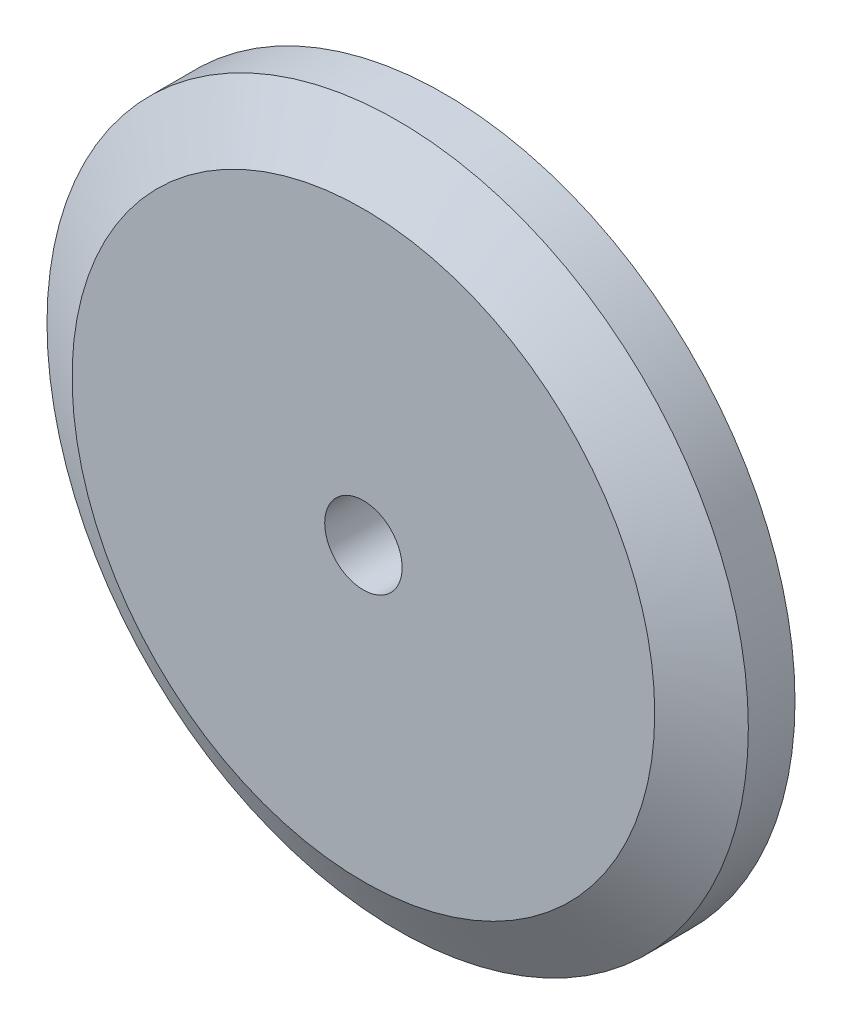
ISO-10303-21;
HEADER;
FILE_DESCRIPTION(('STEP AP214'),'2;1');
FILE_NAME('part.step','',(''),(''),'','','');
FILE_SCHEMA(('AUTOMOTIVE_DESIGN { 1 0 10303 214 1 1 1 1 }'));
ENDSEC;
DATA;
#1=APPLICATION_CONTEXT('core data for automotive mechanical design processes');
#2=APPLICATION_PROTOCOL_DEFINITION('international standard','automotive_design',2000,#1);
#3=PRODUCT_CONTEXT('',#1,'mechanical');
#4=PRODUCT('Part','Part','',(#3));
#5=PRODUCT_RELATED_PRODUCT_CATEGORY('part','',(#4));
#6=PRODUCT_DEFINITION_FORMATION('','',#4);
#7=PRODUCT_DEFINITION_CONTEXT('part definition',#1,'design');
#8=PRODUCT_DEFINITION('design','',#6,#7);
#9=PRODUCT_DEFINITION_SHAPE('','',#8);
#10=(LENGTH_UNIT() NAMED_UNIT(*) SI_UNIT(.MILLI.,.METRE.));
#11=(NAMED_UNIT(*) PLANE_ANGLE_UNIT() SI_UNIT($,.RADIAN.));
#12=(NAMED_UNIT(*) SI_UNIT($,.STERADIAN.) SOLID_ANGLE_UNIT());
#13=UNCERTAINTY_MEASURE_WITH_UNIT(LENGTH_MEASURE(1.E-05),#10,'distance_accuracy_value','');
#14=(GEOMETRIC_REPRESENTATION_CONTEXT(3) GLOBAL_UNCERTAINTY_ASSIGNED_CONTEXT((#13)) GLOBAL_UNIT_ASSIGNED_CONTEXT((#10,
#11,#12)) REPRESENTATION_CONTEXT('',''));
#15=CARTESIAN_POINT('',(0.,0.,0.));
#16=DIRECTION('',(0.,0.,1.));
#17=DIRECTION('',(1.,0.,0.));
#18=AXIS2_PLACEMENT_3D('',#15,#16,#17);
#19=CARTESIAN_POINT('',(40.3999999720001,-23.75,-0.49999999999999));
#20=DIRECTION('',(0.,0.,1.));
#21=DIRECTION('',(1.,0.,0.));
#22=AXIS2_PLACEMENT_3D('',#19,#20,#21);
#23=PLANE('',#22);
#24=CARTESIAN_POINT('',(40.3999999720001,-23.75,-0.49999999999999));
#25=DIRECTION('',(0.,0.,1.));
#26=DIRECTION('',(1.,0.,0.));
#27=AXIS2_PLACEMENT_3D('',#24,#25,#26);
#28=CIRCLE('',#27,5.5);
#29=CARTESIAN_POINT('',(45.8999999720001,-23.75,-0.49999999999999));
#30=VERTEX_POINT('',#29);
#31=EDGE_CURVE('E57',#30,#30,#28,.T.);
#32=ORIENTED_EDGE('',*,*,#31,.F.);
#33=EDGE_LOOP('',(#32));
#34=FACE_BOUND('',#33,.T.);
#35=CARTESIAN_POINT('',(40.3999999720001,-23.75,-0.49999999999999));
#36=DIRECTION('',(0.,0.,1.));
#37=DIRECTION('',(1.,0.,0.));
#38=AXIS2_PLACEMENT_3D('',#35,#36,#37);
#39=CIRCLE('',#38,3.92299999999998);
#40=CARTESIAN_POINT('',(44.322999972,-23.75,-0.49999999999999));
#41=VERTEX_POINT('',#40);
#42=EDGE_CURVE('E61',#41,#41,#39,.T.);
#43=ORIENTED_EDGE('',*,*,#42,.T.);
#44=EDGE_LOOP('',(#43));
#45=FACE_BOUND('',#44,.T.);
#46=ADVANCED_FACE('F36',(#34,#45),#23,.F.);
#47=CARTESIAN_POINT('',(40.3999999720001,-23.75,0.));
#48=DIRECTION('',(0.,0.,-1.));
#49=DIRECTION('',(-1.,0.,0.));
#50=AXIS2_PLACEMENT_3D('',#47,#48,#49);
#51=CYLINDRICAL_SURFACE('',#50,5.5);
#52=CARTESIAN_POINT('',(40.3999999720001,-23.75,0.));
#53=DIRECTION('',(0.,0.,1.));
#54=DIRECTION('',(1.,0.,0.));
#55=AXIS2_PLACEMENT_3D('',#52,#53,#54);
#56=CIRCLE('',#55,5.5);
#57=CARTESIAN_POINT('',(45.8999999720001,-23.75,0.));
#58=VERTEX_POINT('',#57);
#59=EDGE_CURVE('E51',#58,#58,#56,.T.);
#60=ORIENTED_EDGE('',*,*,#59,.F.);
#61=EDGE_LOOP('',(#60));
#62=FACE_BOUND('',#61,.T.);
#63=ORIENTED_EDGE('',*,*,#31,.T.);
#64=EDGE_LOOP('',(#63));
#65=FACE_BOUND('',#64,.T.);
#66=ADVANCED_FACE('F100',(#62,#65),#51,.T.);
#67=CARTESIAN_POINT('',(40.3999999720001,-23.75,0.));
#68=DIRECTION('',(0.,0.,-1.));
#69=DIRECTION('',(-1.,0.,0.));
#70=AXIS2_PLACEMENT_3D('',#67,#68,#69);
#71=CYLINDRICAL_SURFACE('',#70,3.92299999999998);
#72=CARTESIAN_POINT('',(40.3999999720001,-23.75,0.));
#73=DIRECTION('',(0.,0.,1.));
#74=DIRECTION('',(1.,0.,0.));
#75=AXIS2_PLACEMENT_3D('',#72,#73,#74);
#76=CIRCLE('',#75,3.92299999999998);
#77=CARTESIAN_POINT('',(44.322999972,-23.75,0.));
#78=VERTEX_POINT('',#77);
#79=EDGE_CURVE('E66',#78,#78,#76,.T.);
#80=ORIENTED_EDGE('',*,*,#79,.T.);
#81=EDGE_LOOP('',(#80));
#82=FACE_BOUND('',#81,.T.);
#83=ORIENTED_EDGE('',*,*,#42,.F.);
#84=EDGE_LOOP('',(#83));
#85=FACE_BOUND('',#84,.T.);
#86=ADVANCED_FACE('F94',(#82,#85),#71,.F.);
#87=CARTESIAN_POINT('',(0.,0.,0.));
#88=DIRECTION('',(0.,0.,1.));
#89=DIRECTION('',(1.,0.,0.));
#90=AXIS2_PLACEMENT_3D('',#87,#88,#89);
#91=PLANE('',#90);
#92=CARTESIAN_POINT('',(40.3999999720001,-23.75,0.));
#93=DIRECTION('',(0.,0.,-1.));
#94=DIRECTION('',(-1.,0.,0.));
#95=AXIS2_PLACEMENT_3D('',#92,#93,#94);
#96=CIRCLE('',#95,1.43499999999999);
#97=CARTESIAN_POINT('',(38.9649999720001,-23.75,0.));
#98=VERTEX_POINT('',#97);
#99=EDGE_CURVE('E74',#98,#98,#96,.T.);
#100=ORIENTED_EDGE('',*,*,#99,.F.);
#101=EDGE_LOOP('',(#100));
#102=FACE_BOUND('',#101,.T.);
#103=ORIENTED_EDGE('',*,*,#79,.F.);
#104=EDGE_LOOP('',(#103));
#105=FACE_BOUND('',#104,.T.);
#106=ADVANCED_FACE('F90',(#102,#105),#91,.F.);
#107=CARTESIAN_POINT('',(40.3999999720001,-23.75,3.));
#108=DIRECTION('',(0.,0.,-1.));
#109=DIRECTION('',(-1.,0.,0.));
#110=AXIS2_PLACEMENT_3D('',#107,#108,#109);
#111=CYLINDRICAL_SURFACE('',#110,13.);
#112=CARTESIAN_POINT('',(40.3999999720001,-23.75,1.72999999999999));
#113=DIRECTION('',(0.,0.,1.));
#114=DIRECTION('',(1.,0.,0.));
#115=AXIS2_PLACEMENT_3D('',#112,#113,#114);
#116=CIRCLE('',#115,13.);
#117=CARTESIAN_POINT('',(53.3999999720001,-23.75,1.72999999999999));
#118=VERTEX_POINT('',#117);
#119=EDGE_CURVE('E10',#118,#118,#116,.F.);
#120=ORIENTED_EDGE('',*,*,#119,.T.);
#121=EDGE_LOOP('',(#120));
#122=FACE_BOUND('',#121,.T.);
#123=CARTESIAN_POINT('',(40.3999999720001,-23.75,0.));
#124=DIRECTION('',(0.,0.,1.));
#125=DIRECTION('',(1.,0.,0.));
#126=AXIS2_PLACEMENT_3D('',#123,#124,#125);
#127=CIRCLE('',#126,13.);
#128=CARTESIAN_POINT('',(53.3999999720001,-23.75,0.));
#129=VERTEX_POINT('',#128);
#130=EDGE_CURVE('E70',#129,#129,#127,.T.);
#131=ORIENTED_EDGE('',*,*,#130,.T.);
#132=EDGE_LOOP('',(#131));
#133=FACE_BOUND('',#132,.T.);
#134=ADVANCED_FACE('F93',(#122,#133),#111,.T.);
#135=CARTESIAN_POINT('',(0.,0.,3.));
#136=DIRECTION('',(0.,0.,1.));
#137=DIRECTION('',(1.,0.,0.));
#138=AXIS2_PLACEMENT_3D('',#135,#136,#137);
#139=PLANE('',#138);
#140=CARTESIAN_POINT('',(40.3999999720001,-23.75,3.));
#141=DIRECTION('',(0.,0.,1.));
#142=DIRECTION('',(1.,0.,0.));
#143=AXIS2_PLACEMENT_3D('',#140,#141,#142);
#144=CIRCLE('',#143,10.8002954743875);
#145=CARTESIAN_POINT('',(51.2002954463876,-23.75,3.));
#146=VERTEX_POINT('',#145);
#147=EDGE_CURVE('E44',#146,#146,#144,.T.);
#148=ORIENTED_EDGE('',*,*,#147,.T.);
#149=EDGE_LOOP('',(#148));
#150=FACE_BOUND('',#149,.T.);
#151=CARTESIAN_POINT('',(40.3999999720001,-23.75,3.));
#152=DIRECTION('',(0.,0.,-1.));
#153=DIRECTION('',(-1.,0.,0.));
#154=AXIS2_PLACEMENT_3D('',#151,#152,#153);
#155=CIRCLE('',#154,1.43499999999999);
#156=CARTESIAN_POINT('',(38.9649999720001,-23.75,3.));
#157=VERTEX_POINT('',#156);
#158=EDGE_CURVE('E73',#157,#157,#155,.T.);
#159=ORIENTED_EDGE('',*,*,#158,.T.);
#160=EDGE_LOOP('',(#159));
#161=FACE_BOUND('',#160,.T.);
#162=ADVANCED_FACE('F81',(#150,#161),#139,.T.);
#163=ORIENTED_EDGE('',*,*,#59,.T.);
#164=EDGE_LOOP('',(#163));
#165=FACE_BOUND('',#164,.T.);
#166=ORIENTED_EDGE('',*,*,#130,.F.);
#167=EDGE_LOOP('',(#166));
#168=FACE_BOUND('',#167,.T.);
#169=ADVANCED_FACE('F86',(#165,#168),#91,.F.);
#170=CARTESIAN_POINT('',(40.3999999720001,-23.75,3.));
#171=DIRECTION('',(0.,0.,-1.));
#172=DIRECTION('',(-1.,0.,0.));
#173=AXIS2_PLACEMENT_3D('',#170,#171,#172);
#174=CYLINDRICAL_SURFACE('',#173,1.43499999999999);
#175=ORIENTED_EDGE('',*,*,#158,.F.);
#176=EDGE_LOOP('',(#175));
#177=FACE_BOUND('',#176,.T.);
#178=ORIENTED_EDGE('',*,*,#99,.T.);
#179=EDGE_LOOP('',(#178));
#180=FACE_BOUND('',#179,.T.);
#181=ADVANCED_FACE('F83',(#177,#180),#174,.F.);
#182=CARTESIAN_POINT('',(40.3999999720001,-23.75,3.));
#183=DIRECTION('',(0.,0.,-1.));
#184=DIRECTION('',(-1.,0.,0.));
#185=AXIS2_PLACEMENT_3D('',#182,#183,#184);
#186=CONICAL_SURFACE('',#185,10.8002954743875,1.0471975511966);
#187=ORIENTED_EDGE('',*,*,#119,.F.);
#188=EDGE_LOOP('',(#187));
#189=FACE_BOUND('',#188,.T.);
#190=ORIENTED_EDGE('',*,*,#147,.F.);
#191=EDGE_LOOP('',(#190));
#192=FACE_BOUND('',#191,.T.);
#193=ADVANCED_FACE('F38',(#189,#192),#186,.T.);
#194=CLOSED_SHELL('',(#46,#66,#86,#106,#134,#162,#169,#181,#193));
#195=MANIFOLD_SOLID_BREP('B2',#194);
#196=ADVANCED_BREP_SHAPE_REPRESENTATION('',(#18,#195),#14);
#197=SHAPE_DEFINITION_REPRESENTATION(#9,#196);
ENDSEC;
END-ISO-10303-21;
